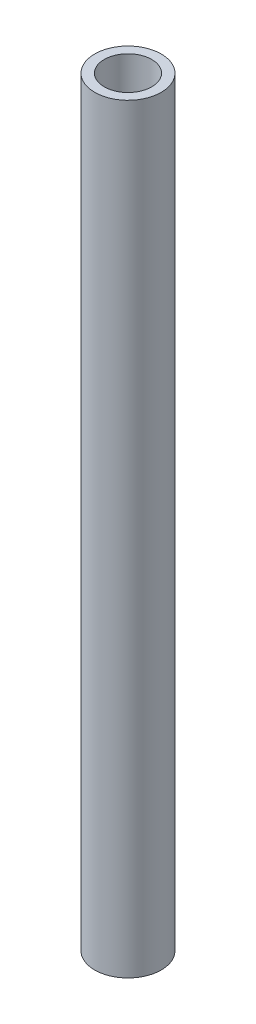
ISO-10303-21;
HEADER;
FILE_DESCRIPTION(('STEP AP214'),'2;1');
FILE_NAME('part.step','',(''),(''),'','','');
FILE_SCHEMA(('AUTOMOTIVE_DESIGN { 1 0 10303 214 1 1 1 1 }'));
ENDSEC;
DATA;
#1=APPLICATION_CONTEXT('core data for automotive mechanical design processes');
#2=APPLICATION_PROTOCOL_DEFINITION('international standard','automotive_design',2000,#1);
#3=PRODUCT_CONTEXT('',#1,'mechanical');
#4=PRODUCT('Part','Part','',(#3));
#5=PRODUCT_RELATED_PRODUCT_CATEGORY('part','',(#4));
#6=PRODUCT_DEFINITION_FORMATION('','',#4);
#7=PRODUCT_DEFINITION_CONTEXT('part definition',#1,'design');
#8=PRODUCT_DEFINITION('design','',#6,#7);
#9=PRODUCT_DEFINITION_SHAPE('','',#8);
#10=(LENGTH_UNIT() NAMED_UNIT(*) SI_UNIT(.MILLI.,.METRE.));
#11=(NAMED_UNIT(*) PLANE_ANGLE_UNIT() SI_UNIT($,.RADIAN.));
#12=(NAMED_UNIT(*) SI_UNIT($,.STERADIAN.) SOLID_ANGLE_UNIT());
#13=UNCERTAINTY_MEASURE_WITH_UNIT(LENGTH_MEASURE(1.E-05),#10,'distance_accuracy_value','');
#14=(GEOMETRIC_REPRESENTATION_CONTEXT(3) GLOBAL_UNCERTAINTY_ASSIGNED_CONTEXT((#13)) GLOBAL_UNIT_ASSIGNED_CONTEXT((#10,
#11,#12)) REPRESENTATION_CONTEXT('',''));
#15=CARTESIAN_POINT('',(0.,0.,0.));
#16=DIRECTION('',(0.,0.,1.));
#17=DIRECTION('',(1.,0.,0.));
#18=AXIS2_PLACEMENT_3D('',#15,#16,#17);
#19=CARTESIAN_POINT('',(0.,40.,0.));
#20=DIRECTION('',(0.,1.,0.));
#21=DIRECTION('',(0.,0.,1.));
#22=AXIS2_PLACEMENT_3D('',#19,#20,#21);
#23=PLANE('',#22);
#24=CARTESIAN_POINT('',(0.,40.,0.));
#25=DIRECTION('',(0.,1.,0.));
#26=DIRECTION('',(0.,0.,1.));
#27=AXIS2_PLACEMENT_3D('',#24,#25,#26);
#28=CIRCLE('',#27,3.5);
#29=CARTESIAN_POINT('',(0.,40.,3.5));
#30=VERTEX_POINT('',#29);
#31=EDGE_CURVE('E10',#30,#30,#28,.T.);
#32=ORIENTED_EDGE('',*,*,#31,.T.);
#33=EDGE_LOOP('',(#32));
#34=FACE_BOUND('',#33,.T.);
#35=CARTESIAN_POINT('',(0.,40.,0.));
#36=DIRECTION('',(0.,1.,0.));
#37=DIRECTION('',(0.,0.,1.));
#38=AXIS2_PLACEMENT_3D('',#35,#36,#37);
#39=CIRCLE('',#38,2.5);
#40=CARTESIAN_POINT('',(0.,40.,2.5));
#41=VERTEX_POINT('',#40);
#42=EDGE_CURVE('E50',#41,#41,#39,.T.);
#43=ORIENTED_EDGE('',*,*,#42,.F.);
#44=EDGE_LOOP('',(#43));
#45=FACE_BOUND('',#44,.T.);
#46=ADVANCED_FACE('F37',(#34,#45),#23,.T.);
#47=CARTESIAN_POINT('',(0.,-40.,0.));
#48=DIRECTION('',(0.,1.,0.));
#49=DIRECTION('',(0.,0.,1.));
#50=AXIS2_PLACEMENT_3D('',#47,#48,#49);
#51=PLANE('',#50);
#52=CARTESIAN_POINT('',(0.,-40.,0.));
#53=DIRECTION('',(0.,1.,0.));
#54=DIRECTION('',(0.,0.,1.));
#55=AXIS2_PLACEMENT_3D('',#52,#53,#54);
#56=CIRCLE('',#55,3.5);
#57=CARTESIAN_POINT('',(0.,-40.,3.5));
#58=VERTEX_POINT('',#57);
#59=EDGE_CURVE('E41',#58,#58,#56,.T.);
#60=ORIENTED_EDGE('',*,*,#59,.F.);
#61=EDGE_LOOP('',(#60));
#62=FACE_BOUND('',#61,.T.);
#63=CARTESIAN_POINT('',(0.,-40.,0.));
#64=DIRECTION('',(0.,1.,0.));
#65=DIRECTION('',(0.,0.,1.));
#66=AXIS2_PLACEMENT_3D('',#63,#64,#65);
#67=CIRCLE('',#66,2.5);
#68=CARTESIAN_POINT('',(0.,-40.,2.5));
#69=VERTEX_POINT('',#68);
#70=EDGE_CURVE('E52',#69,#69,#67,.T.);
#71=ORIENTED_EDGE('',*,*,#70,.T.);
#72=EDGE_LOOP('',(#71));
#73=FACE_BOUND('',#72,.T.);
#74=ADVANCED_FACE('F64',(#62,#73),#51,.F.);
#75=CARTESIAN_POINT('',(0.,40.,0.));
#76=DIRECTION('',(0.,-1.,0.));
#77=DIRECTION('',(0.,0.,-1.));
#78=AXIS2_PLACEMENT_3D('',#75,#76,#77);
#79=CYLINDRICAL_SURFACE('',#78,3.5);
#80=ORIENTED_EDGE('',*,*,#31,.F.);
#81=EDGE_LOOP('',(#80));
#82=FACE_BOUND('',#81,.T.);
#83=ORIENTED_EDGE('',*,*,#59,.T.);
#84=EDGE_LOOP('',(#83));
#85=FACE_BOUND('',#84,.T.);
#86=ADVANCED_FACE('F39',(#82,#85),#79,.T.);
#87=CARTESIAN_POINT('',(0.,40.,0.));
#88=DIRECTION('',(0.,-1.,0.));
#89=DIRECTION('',(0.,0.,-1.));
#90=AXIS2_PLACEMENT_3D('',#87,#88,#89);
#91=CYLINDRICAL_SURFACE('',#90,2.5);
#92=ORIENTED_EDGE('',*,*,#42,.T.);
#93=EDGE_LOOP('',(#92));
#94=FACE_BOUND('',#93,.T.);
#95=ORIENTED_EDGE('',*,*,#70,.F.);
#96=EDGE_LOOP('',(#95));
#97=FACE_BOUND('',#96,.T.);
#98=ADVANCED_FACE('F60',(#94,#97),#91,.F.);
#99=CLOSED_SHELL('',(#46,#74,#86,#98));
#100=MANIFOLD_SOLID_BREP('B2',#99);
#101=ADVANCED_BREP_SHAPE_REPRESENTATION('',(#18,#100),#14);
#102=SHAPE_DEFINITION_REPRESENTATION(#9,#101);
ENDSEC;
END-ISO-10303-21;
